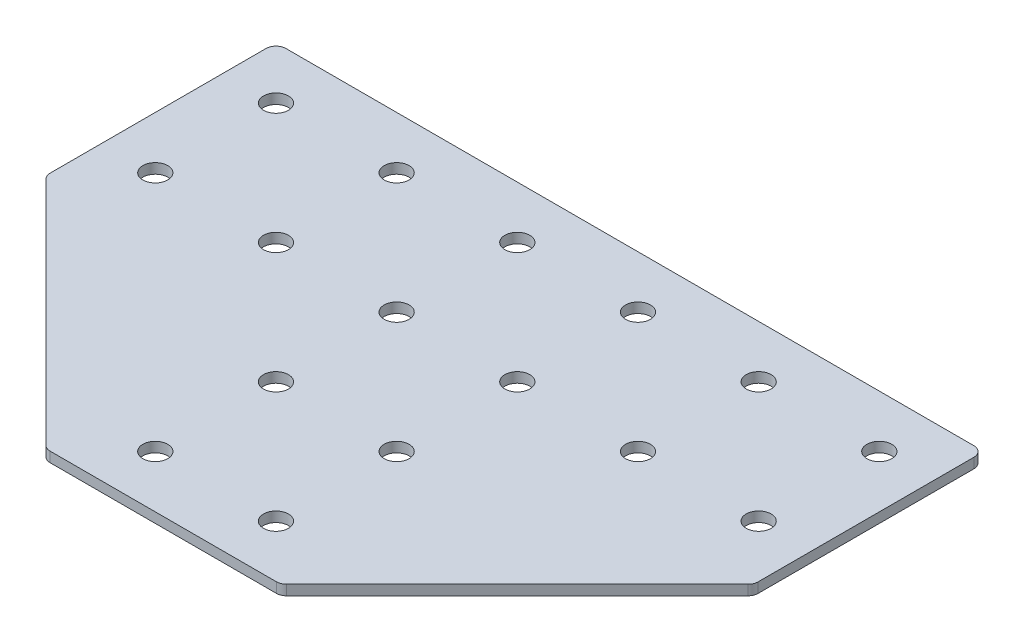
ISO-10303-21;
HEADER;
FILE_DESCRIPTION(('STEP AP214'),'2;1');
FILE_NAME('part.step','',(''),(''),'','','');
FILE_SCHEMA(('AUTOMOTIVE_DESIGN { 1 0 10303 214 1 1 1 1 }'));
ENDSEC;
DATA;
#1=APPLICATION_CONTEXT('core data for automotive mechanical design processes');
#2=APPLICATION_PROTOCOL_DEFINITION('international standard','automotive_design',2000,#1);
#3=PRODUCT_CONTEXT('',#1,'mechanical');
#4=PRODUCT('Part','Part','',(#3));
#5=PRODUCT_RELATED_PRODUCT_CATEGORY('part','',(#4));
#6=PRODUCT_DEFINITION_FORMATION('','',#4);
#7=PRODUCT_DEFINITION_CONTEXT('part definition',#1,'design');
#8=PRODUCT_DEFINITION('design','',#6,#7);
#9=PRODUCT_DEFINITION_SHAPE('','',#8);
#10=(LENGTH_UNIT() NAMED_UNIT(*) SI_UNIT(.MILLI.,.METRE.));
#11=(NAMED_UNIT(*) PLANE_ANGLE_UNIT() SI_UNIT($,.RADIAN.));
#12=(NAMED_UNIT(*) SI_UNIT($,.STERADIAN.) SOLID_ANGLE_UNIT());
#13=UNCERTAINTY_MEASURE_WITH_UNIT(LENGTH_MEASURE(1.E-05),#10,'distance_accuracy_value','');
#14=(GEOMETRIC_REPRESENTATION_CONTEXT(3) GLOBAL_UNCERTAINTY_ASSIGNED_CONTEXT((#13)) GLOBAL_UNIT_ASSIGNED_CONTEXT((#10,
#11,#12)) REPRESENTATION_CONTEXT('',''));
#15=CARTESIAN_POINT('',(0.,0.,0.));
#16=DIRECTION('',(0.,0.,1.));
#17=DIRECTION('',(1.,0.,0.));
#18=AXIS2_PLACEMENT_3D('',#15,#16,#17);
#19=CARTESIAN_POINT('',(-1.82872212002394,1.45798729377475,-30.8788250855786));
#20=DIRECTION('',(0.,-1.,0.));
#21=DIRECTION('',(0.,0.,-1.));
#22=AXIS2_PLACEMENT_3D('',#19,#20,#21);
#23=PLANE('',#22);
#24=DIRECTION('',(1.,0.,0.));
#25=VECTOR('',#24,1.);
#26=CARTESIAN_POINT('',(-29.828722120024,1.45798729377475,57.1211749144213));
#27=LINE('',#26,#25);
#28=CARTESIAN_POINT('',(-29.9647610893451,1.45798729377475,57.1211749144213));
#29=VERTEX_POINT('',#28);
#30=CARTESIAN_POINT('',(26.3073168492972,1.45798729377475,57.1211749144213));
#31=VERTEX_POINT('',#30);
#32=EDGE_CURVE('E218',#29,#31,#27,.T.);
#33=ORIENTED_EDGE('',*,*,#32,.F.);
#34=CARTESIAN_POINT('',(-29.9647610893451,1.45798729377475,54.6211749144213));
#35=DIRECTION('',(0.,1.,0.));
#36=DIRECTION('',(0.,0.,-1.));
#37=AXIS2_PLACEMENT_3D('',#34,#35,#36);
#38=CIRCLE('',#37,2.5);
#39=CARTESIAN_POINT('',(-31.7325280423115,1.45798729377475,56.3889418673877));
#40=VERTEX_POINT('',#39);
#41=EDGE_CURVE('E154',#40,#29,#38,.T.);
#42=ORIENTED_EDGE('',*,*,#41,.F.);
#43=DIRECTION('',(-0.707106781186547,0.,-0.707106781186548));
#44=VECTOR('',#43,1.);
#45=CARTESIAN_POINT('',(-31.0002949952778,1.45798729377475,57.1211749144213));
#46=LINE('',#45,#44);
#47=CARTESIAN_POINT('',(-89.0964890729902,1.45798729377475,-0.975019163291117));
#48=VERTEX_POINT('',#47);
#49=EDGE_CURVE('E141',#40,#48,#46,.T.);
#50=ORIENTED_EDGE('',*,*,#49,.T.);
#51=CARTESIAN_POINT('',(-87.3287221200238,1.45798729377475,-2.74278611625748));
#52=DIRECTION('',(0.,1.,0.));
#53=DIRECTION('',(0.,0.,-1.));
#54=AXIS2_PLACEMENT_3D('',#51,#52,#53);
#55=CIRCLE('',#54,2.5);
#56=CARTESIAN_POINT('',(-89.8287221200238,1.45798729377475,-2.74278611625748));
#57=VERTEX_POINT('',#56);
#58=EDGE_CURVE('E152',#57,#48,#55,.T.);
#59=ORIENTED_EDGE('',*,*,#58,.F.);
#60=DIRECTION('',(0.,0.,-1.));
#61=VECTOR('',#60,1.);
#62=CARTESIAN_POINT('',(-89.8287221200238,1.45798729377475,-1.70725221032476));
#63=LINE('',#62,#61);
#64=CARTESIAN_POINT('',(-89.8287221200238,1.45798729377475,-56.3788250855787));
#65=VERTEX_POINT('',#64);
#66=EDGE_CURVE('E124',#57,#65,#63,.T.);
#67=ORIENTED_EDGE('',*,*,#66,.T.);
#68=CARTESIAN_POINT('',(-87.3287221200238,1.45798729377475,-56.3788250855787));
#69=DIRECTION('',(0.,1.,0.));
#70=DIRECTION('',(0.,0.,-1.));
#71=AXIS2_PLACEMENT_3D('',#68,#69,#70);
#72=CIRCLE('',#71,2.5);
#73=CARTESIAN_POINT('',(-87.3287221200238,1.45798729377475,-58.8788250855787));
#74=VERTEX_POINT('',#73);
#75=EDGE_CURVE('E149',#74,#65,#72,.T.);
#76=ORIENTED_EDGE('',*,*,#75,.F.);
#77=DIRECTION('',(-1.,0.,0.));
#78=VECTOR('',#77,1.);
#79=CARTESIAN_POINT('',(86.1712778799759,1.45798729377475,-58.8788250855787));
#80=LINE('',#79,#78);
#81=CARTESIAN_POINT('',(83.6712778799759,1.45798729377475,-58.8788250855787));
#82=VERTEX_POINT('',#81);
#83=EDGE_CURVE('E215',#82,#74,#80,.T.);
#84=ORIENTED_EDGE('',*,*,#83,.F.);
#85=CARTESIAN_POINT('',(83.6712778799759,1.45798729377475,-56.3788250855787));
#86=DIRECTION('',(0.,-1.,0.));
#87=DIRECTION('',(0.,0.,-1.));
#88=AXIS2_PLACEMENT_3D('',#85,#86,#87);
#89=CIRCLE('',#88,2.5);
#90=CARTESIAN_POINT('',(86.1712778799759,1.45798729377475,-56.3788250855787));
#91=VERTEX_POINT('',#90);
#92=EDGE_CURVE('E239',#82,#91,#89,.T.);
#93=ORIENTED_EDGE('',*,*,#92,.T.);
#94=DIRECTION('',(0.,0.,-1.));
#95=VECTOR('',#94,1.);
#96=CARTESIAN_POINT('',(86.1712778799759,1.45798729377475,-1.70725221032478));
#97=LINE('',#96,#95);
#98=CARTESIAN_POINT('',(86.1712778799759,1.45798729377475,-2.7427861162575));
#99=VERTEX_POINT('',#98);
#100=EDGE_CURVE('E212',#99,#91,#97,.T.);
#101=ORIENTED_EDGE('',*,*,#100,.F.);
#102=CARTESIAN_POINT('',(83.6712778799759,1.45798729377475,-2.7427861162575));
#103=DIRECTION('',(0.,-1.,0.));
#104=DIRECTION('',(0.,0.,-1.));
#105=AXIS2_PLACEMENT_3D('',#102,#103,#104);
#106=CIRCLE('',#105,2.5);
#107=CARTESIAN_POINT('',(85.4390448329423,1.45798729377475,-0.975019163291138));
#108=VERTEX_POINT('',#107);
#109=EDGE_CURVE('E31',#99,#108,#106,.T.);
#110=ORIENTED_EDGE('',*,*,#109,.T.);
#111=DIRECTION('',(0.707106781186547,0.,-0.707106781186548));
#112=VECTOR('',#111,1.);
#113=CARTESIAN_POINT('',(27.34285075523,1.45798729377475,57.1211749144213));
#114=LINE('',#113,#112);
#115=CARTESIAN_POINT('',(28.0750838022636,1.45798729377475,56.3889418673877));
#116=VERTEX_POINT('',#115);
#117=EDGE_CURVE('E220',#116,#108,#114,.T.);
#118=ORIENTED_EDGE('',*,*,#117,.F.);
#119=CARTESIAN_POINT('',(26.3073168492972,1.45798729377475,54.6211749144213));
#120=DIRECTION('',(0.,-1.,0.));
#121=DIRECTION('',(0.,0.,-1.));
#122=AXIS2_PLACEMENT_3D('',#119,#120,#121);
#123=CIRCLE('',#122,2.5);
#124=EDGE_CURVE('E242',#116,#31,#123,.T.);
#125=ORIENTED_EDGE('',*,*,#124,.T.);
#126=EDGE_LOOP('',(#33,#42,#50,#59,#67,#76,#84,#93,#101,#110,#118,#125));
#127=FACE_BOUND('',#126,.T.);
#128=CARTESIAN_POINT('',(73.171277879976,1.45798729377475,-15.8788250855786));
#129=DIRECTION('',(0.,1.,0.));
#130=DIRECTION('',(0.,0.,1.));
#131=AXIS2_PLACEMENT_3D('',#128,#129,#130);
#132=CIRCLE('',#131,3.1);
#133=CARTESIAN_POINT('',(73.171277879976,1.45798729377475,-12.7788250855786));
#134=VERTEX_POINT('',#133);
#135=EDGE_CURVE('E164',#134,#134,#132,.T.);
#136=ORIENTED_EDGE('',*,*,#135,.T.);
#137=EDGE_LOOP('',(#136));
#138=FACE_BOUND('',#137,.T.);
#139=CARTESIAN_POINT('',(43.171277879976,1.45798729377475,-15.8788250855786));
#140=DIRECTION('',(0.,1.,0.));
#141=DIRECTION('',(0.,0.,1.));
#142=AXIS2_PLACEMENT_3D('',#139,#140,#141);
#143=CIRCLE('',#142,3.1);
#144=CARTESIAN_POINT('',(43.171277879976,1.45798729377475,-12.7788250855786));
#145=VERTEX_POINT('',#144);
#146=EDGE_CURVE('E170',#145,#145,#143,.T.);
#147=ORIENTED_EDGE('',*,*,#146,.T.);
#148=EDGE_LOOP('',(#147));
#149=FACE_BOUND('',#148,.T.);
#150=CARTESIAN_POINT('',(13.1712778799761,1.45798729377475,44.1211749144214));
#151=DIRECTION('',(0.,1.,0.));
#152=DIRECTION('',(0.,0.,1.));
#153=AXIS2_PLACEMENT_3D('',#150,#151,#152);
#154=CIRCLE('',#153,3.1);
#155=CARTESIAN_POINT('',(13.1712778799761,1.45798729377475,47.2211749144214));
#156=VERTEX_POINT('',#155);
#157=EDGE_CURVE('E176',#156,#156,#154,.T.);
#158=ORIENTED_EDGE('',*,*,#157,.T.);
#159=EDGE_LOOP('',(#158));
#160=FACE_BOUND('',#159,.T.);
#161=CARTESIAN_POINT('',(13.1712778799761,1.45798729377475,14.1211749144214));
#162=DIRECTION('',(0.,1.,0.));
#163=DIRECTION('',(0.,0.,1.));
#164=AXIS2_PLACEMENT_3D('',#161,#162,#163);
#165=CIRCLE('',#164,3.1);
#166=CARTESIAN_POINT('',(13.1712778799761,1.45798729377475,17.2211749144214));
#167=VERTEX_POINT('',#166);
#168=EDGE_CURVE('E182',#167,#167,#165,.T.);
#169=ORIENTED_EDGE('',*,*,#168,.T.);
#170=EDGE_LOOP('',(#169));
#171=FACE_BOUND('',#170,.T.);
#172=CARTESIAN_POINT('',(13.171277879976,1.45798729377475,-15.8788250855786));
#173=DIRECTION('',(0.,1.,0.));
#174=DIRECTION('',(0.,0.,1.));
#175=AXIS2_PLACEMENT_3D('',#172,#173,#174);
#176=CIRCLE('',#175,3.1);
#177=CARTESIAN_POINT('',(13.171277879976,1.45798729377475,-12.7788250855786));
#178=VERTEX_POINT('',#177);
#179=EDGE_CURVE('E188',#178,#178,#176,.T.);
#180=ORIENTED_EDGE('',*,*,#179,.T.);
#181=EDGE_LOOP('',(#180));
#182=FACE_BOUND('',#181,.T.);
#183=CARTESIAN_POINT('',(73.171277879976,1.45798729377475,-45.8788250855786));
#184=DIRECTION('',(0.,1.,0.));
#185=DIRECTION('',(0.,0.,1.));
#186=AXIS2_PLACEMENT_3D('',#183,#184,#185);
#187=CIRCLE('',#186,3.1);
#188=CARTESIAN_POINT('',(73.171277879976,1.45798729377475,-42.7788250855786));
#189=VERTEX_POINT('',#188);
#190=EDGE_CURVE('E194',#189,#189,#187,.T.);
#191=ORIENTED_EDGE('',*,*,#190,.T.);
#192=EDGE_LOOP('',(#191));
#193=FACE_BOUND('',#192,.T.);
#194=CARTESIAN_POINT('',(43.171277879976,1.45798729377475,-45.8788250855786));
#195=DIRECTION('',(0.,1.,0.));
#196=DIRECTION('',(0.,0.,1.));
#197=AXIS2_PLACEMENT_3D('',#194,#195,#196);
#198=CIRCLE('',#197,3.1);
#199=CARTESIAN_POINT('',(43.171277879976,1.45798729377475,-42.7788250855786));
#200=VERTEX_POINT('',#199);
#201=EDGE_CURVE('E200',#200,#200,#198,.T.);
#202=ORIENTED_EDGE('',*,*,#201,.T.);
#203=EDGE_LOOP('',(#202));
#204=FACE_BOUND('',#203,.T.);
#205=CARTESIAN_POINT('',(13.171277879976,1.45798729377475,-45.8788250855786));
#206=DIRECTION('',(0.,1.,0.));
#207=DIRECTION('',(0.,0.,1.));
#208=AXIS2_PLACEMENT_3D('',#205,#206,#207);
#209=CIRCLE('',#208,3.1);
#210=CARTESIAN_POINT('',(13.171277879976,1.45798729377475,-42.7788250855786));
#211=VERTEX_POINT('',#210);
#212=EDGE_CURVE('E206',#211,#211,#209,.T.);
#213=ORIENTED_EDGE('',*,*,#212,.T.);
#214=EDGE_LOOP('',(#213));
#215=FACE_BOUND('',#214,.T.);
#216=CARTESIAN_POINT('',(-76.8287221200239,1.45798729377475,-15.8788250855786));
#217=DIRECTION('',(0.,-1.,0.));
#218=DIRECTION('',(0.,0.,1.));
#219=AXIS2_PLACEMENT_3D('',#216,#217,#218);
#220=CIRCLE('',#219,3.1);
#221=CARTESIAN_POINT('',(-76.8287221200239,1.45798729377475,-12.7788250855786));
#222=VERTEX_POINT('',#221);
#223=EDGE_CURVE('E318',#222,#222,#220,.T.);
#224=ORIENTED_EDGE('',*,*,#223,.F.);
#225=EDGE_LOOP('',(#224));
#226=FACE_BOUND('',#225,.T.);
#227=CARTESIAN_POINT('',(-46.8287221200239,1.45798729377475,-15.8788250855786));
#228=DIRECTION('',(0.,-1.,0.));
#229=DIRECTION('',(0.,0.,1.));
#230=AXIS2_PLACEMENT_3D('',#227,#228,#229);
#231=CIRCLE('',#230,3.1);
#232=CARTESIAN_POINT('',(-46.8287221200239,1.45798729377475,-12.7788250855786));
#233=VERTEX_POINT('',#232);
#234=EDGE_CURVE('E312',#233,#233,#231,.T.);
#235=ORIENTED_EDGE('',*,*,#234,.F.);
#236=EDGE_LOOP('',(#235));
#237=FACE_BOUND('',#236,.T.);
#238=CARTESIAN_POINT('',(-16.8287221200239,1.45798729377475,44.1211749144214));
#239=DIRECTION('',(0.,-1.,0.));
#240=DIRECTION('',(0.,0.,1.));
#241=AXIS2_PLACEMENT_3D('',#238,#239,#240);
#242=CIRCLE('',#241,3.1);
#243=CARTESIAN_POINT('',(-16.8287221200239,1.45798729377475,47.2211749144214));
#244=VERTEX_POINT('',#243);
#245=EDGE_CURVE('E306',#244,#244,#242,.T.);
#246=ORIENTED_EDGE('',*,*,#245,.F.);
#247=EDGE_LOOP('',(#246));
#248=FACE_BOUND('',#247,.T.);
#249=CARTESIAN_POINT('',(-16.8287221200239,1.45798729377475,14.1211749144214));
#250=DIRECTION('',(0.,-1.,0.));
#251=DIRECTION('',(0.,0.,1.));
#252=AXIS2_PLACEMENT_3D('',#249,#250,#251);
#253=CIRCLE('',#252,3.1);
#254=CARTESIAN_POINT('',(-16.8287221200239,1.45798729377475,17.2211749144214));
#255=VERTEX_POINT('',#254);
#256=EDGE_CURVE('E300',#255,#255,#253,.T.);
#257=ORIENTED_EDGE('',*,*,#256,.F.);
#258=EDGE_LOOP('',(#257));
#259=FACE_BOUND('',#258,.T.);
#260=CARTESIAN_POINT('',(-16.8287221200239,1.45798729377475,-15.8788250855786));
#261=DIRECTION('',(0.,-1.,0.));
#262=DIRECTION('',(0.,0.,1.));
#263=AXIS2_PLACEMENT_3D('',#260,#261,#262);
#264=CIRCLE('',#263,3.1);
#265=CARTESIAN_POINT('',(-16.8287221200239,1.45798729377475,-12.7788250855786));
#266=VERTEX_POINT('',#265);
#267=EDGE_CURVE('E294',#266,#266,#264,.T.);
#268=ORIENTED_EDGE('',*,*,#267,.F.);
#269=EDGE_LOOP('',(#268));
#270=FACE_BOUND('',#269,.T.);
#271=CARTESIAN_POINT('',(-76.8287221200239,1.45798729377475,-45.8788250855786));
#272=DIRECTION('',(0.,-1.,0.));
#273=DIRECTION('',(0.,0.,1.));
#274=AXIS2_PLACEMENT_3D('',#271,#272,#273);
#275=CIRCLE('',#274,3.1);
#276=CARTESIAN_POINT('',(-76.8287221200239,1.45798729377475,-42.7788250855786));
#277=VERTEX_POINT('',#276);
#278=EDGE_CURVE('E288',#277,#277,#275,.T.);
#279=ORIENTED_EDGE('',*,*,#278,.F.);
#280=EDGE_LOOP('',(#279));
#281=FACE_BOUND('',#280,.T.);
#282=CARTESIAN_POINT('',(-46.8287221200239,1.45798729377475,-45.8788250855786));
#283=DIRECTION('',(0.,-1.,0.));
#284=DIRECTION('',(0.,0.,1.));
#285=AXIS2_PLACEMENT_3D('',#282,#283,#284);
#286=CIRCLE('',#285,3.1);
#287=CARTESIAN_POINT('',(-46.8287221200239,1.45798729377475,-42.7788250855786));
#288=VERTEX_POINT('',#287);
#289=EDGE_CURVE('E283',#288,#288,#286,.T.);
#290=ORIENTED_EDGE('',*,*,#289,.F.);
#291=EDGE_LOOP('',(#290));
#292=FACE_BOUND('',#291,.T.);
#293=CARTESIAN_POINT('',(-16.8287221200239,1.45798729377475,-45.8788250855786));
#294=DIRECTION('',(0.,-1.,0.));
#295=DIRECTION('',(0.,0.,1.));
#296=AXIS2_PLACEMENT_3D('',#293,#294,#295);
#297=CIRCLE('',#296,3.1);
#298=CARTESIAN_POINT('',(-16.8287221200239,1.45798729377475,-42.7788250855786));
#299=VERTEX_POINT('',#298);
#300=EDGE_CURVE('E134',#299,#299,#297,.T.);
#301=ORIENTED_EDGE('',*,*,#300,.F.);
#302=EDGE_LOOP('',(#301));
#303=FACE_BOUND('',#302,.T.);
#304=ADVANCED_FACE('F16',(#127,#138,#149,#160,#171,#182,#193,#204,#215,#226,#237,#248,#259,#270,
#281,#292,#303),#23,.T.);
#305=CARTESIAN_POINT('',(86.1712778799759,1.45798729377475,-1.70725221032478));
#306=DIRECTION('',(1.,0.,0.));
#307=DIRECTION('',(0.,0.,-1.));
#308=AXIS2_PLACEMENT_3D('',#305,#306,#307);
#309=PLANE('',#308);
#310=DIRECTION('',(0.,0.,-1.));
#311=VECTOR('',#310,1.);
#312=CARTESIAN_POINT('',(86.1712778799759,3.95798729377475,-1.70725221032478));
#313=LINE('',#312,#311);
#314=CARTESIAN_POINT('',(86.1712778799759,3.95798729377475,-2.7427861162575));
#315=VERTEX_POINT('',#314);
#316=CARTESIAN_POINT('',(86.1712778799759,3.95798729377475,-56.3788250855787));
#317=VERTEX_POINT('',#316);
#318=EDGE_CURVE('E209',#315,#317,#313,.T.);
#319=ORIENTED_EDGE('',*,*,#318,.F.);
#320=DIRECTION('',(0.,1.,0.));
#321=VECTOR('',#320,1.);
#322=CARTESIAN_POINT('',(86.1712778799759,1.45798729377475,-2.7427861162575));
#323=LINE('',#322,#321);
#324=EDGE_CURVE('E24',#315,#99,#323,.F.);
#325=ORIENTED_EDGE('',*,*,#324,.T.);
#326=ORIENTED_EDGE('',*,*,#100,.T.);
#327=DIRECTION('',(0.,1.,0.));
#328=VECTOR('',#327,1.);
#329=CARTESIAN_POINT('',(86.1712778799759,1.45798729377475,-56.3788250855787));
#330=LINE('',#329,#328);
#331=EDGE_CURVE('E249',#91,#317,#330,.T.);
#332=ORIENTED_EDGE('',*,*,#331,.T.);
#333=EDGE_LOOP('',(#319,#325,#326,#332));
#334=FACE_BOUND('',#333,.T.);
#335=ADVANCED_FACE('F254',(#334),#309,.T.);
#336=CARTESIAN_POINT('',(27.34285075523,1.45798729377475,57.1211749144213));
#337=DIRECTION('',(0.707106781186548,0.,0.707106781186547));
#338=DIRECTION('',(0.707106781186547,0.,-0.707106781186548));
#339=AXIS2_PLACEMENT_3D('',#336,#337,#338);
#340=PLANE('',#339);
#341=DIRECTION('',(0.707106781186547,0.,-0.707106781186548));
#342=VECTOR('',#341,1.);
#343=CARTESIAN_POINT('',(27.34285075523,3.95798729377475,57.1211749144213));
#344=LINE('',#343,#342);
#345=CARTESIAN_POINT('',(28.0750838022636,3.95798729377475,56.3889418673877));
#346=VERTEX_POINT('',#345);
#347=CARTESIAN_POINT('',(85.4390448329423,3.95798729377475,-0.975019163291138));
#348=VERTEX_POINT('',#347);
#349=EDGE_CURVE('E216',#346,#348,#344,.T.);
#350=ORIENTED_EDGE('',*,*,#349,.F.);
#351=DIRECTION('',(0.,1.,0.));
#352=VECTOR('',#351,1.);
#353=CARTESIAN_POINT('',(28.0750838022636,1.45798729377475,56.3889418673877));
#354=LINE('',#353,#352);
#355=EDGE_CURVE('E38',#346,#116,#354,.F.);
#356=ORIENTED_EDGE('',*,*,#355,.T.);
#357=ORIENTED_EDGE('',*,*,#117,.T.);
#358=DIRECTION('',(0.,1.,0.));
#359=VECTOR('',#358,1.);
#360=CARTESIAN_POINT('',(85.4390448329423,1.45798729377475,-0.975019163291138));
#361=LINE('',#360,#359);
#362=EDGE_CURVE('E245',#108,#348,#361,.T.);
#363=ORIENTED_EDGE('',*,*,#362,.T.);
#364=EDGE_LOOP('',(#350,#356,#357,#363));
#365=FACE_BOUND('',#364,.T.);
#366=ADVANCED_FACE('F262',(#365),#340,.T.);
#367=CARTESIAN_POINT('',(-29.828722120024,1.45798729377475,57.1211749144213));
#368=DIRECTION('',(0.,0.,1.));
#369=DIRECTION('',(1.,0.,0.));
#370=AXIS2_PLACEMENT_3D('',#367,#368,#369);
#371=PLANE('',#370);
#372=DIRECTION('',(1.,0.,0.));
#373=VECTOR('',#372,1.);
#374=CARTESIAN_POINT('',(-29.828722120024,3.95798729377475,57.1211749144213));
#375=LINE('',#374,#373);
#376=CARTESIAN_POINT('',(-29.9647610893451,3.95798729377475,57.1211749144213));
#377=VERTEX_POINT('',#376);
#378=CARTESIAN_POINT('',(26.3073168492972,3.95798729377475,57.1211749144213));
#379=VERTEX_POINT('',#378);
#380=EDGE_CURVE('E227',#377,#379,#375,.T.);
#381=ORIENTED_EDGE('',*,*,#380,.F.);
#382=DIRECTION('',(0.,1.,0.));
#383=VECTOR('',#382,1.);
#384=CARTESIAN_POINT('',(-29.9647610893451,1.45798729377475,57.1211749144213));
#385=LINE('',#384,#383);
#386=EDGE_CURVE('E146',#29,#377,#385,.T.);
#387=ORIENTED_EDGE('',*,*,#386,.F.);
#388=ORIENTED_EDGE('',*,*,#32,.T.);
#389=DIRECTION('',(0.,1.,0.));
#390=VECTOR('',#389,1.);
#391=CARTESIAN_POINT('',(26.3073168492972,1.45798729377475,57.1211749144213));
#392=LINE('',#391,#390);
#393=EDGE_CURVE('E236',#31,#379,#392,.T.);
#394=ORIENTED_EDGE('',*,*,#393,.T.);
#395=EDGE_LOOP('',(#381,#387,#388,#394));
#396=FACE_BOUND('',#395,.T.);
#397=ADVANCED_FACE('F270',(#396),#371,.T.);
#398=CARTESIAN_POINT('',(86.1712778799759,1.45798729377475,-58.8788250855787));
#399=DIRECTION('',(0.,0.,-1.));
#400=DIRECTION('',(-1.,0.,0.));
#401=AXIS2_PLACEMENT_3D('',#398,#399,#400);
#402=PLANE('',#401);
#403=ORIENTED_EDGE('',*,*,#83,.T.);
#404=DIRECTION('',(0.,1.,0.));
#405=VECTOR('',#404,1.);
#406=CARTESIAN_POINT('',(-87.3287221200238,1.45798729377475,-58.8788250855787));
#407=LINE('',#406,#405);
#408=CARTESIAN_POINT('',(-87.3287221200238,3.95798729377475,-58.8788250855787));
#409=VERTEX_POINT('',#408);
#410=EDGE_CURVE('E126',#409,#74,#407,.F.);
#411=ORIENTED_EDGE('',*,*,#410,.F.);
#412=DIRECTION('',(-1.,0.,0.));
#413=VECTOR('',#412,1.);
#414=CARTESIAN_POINT('',(86.1712778799759,3.95798729377475,-58.8788250855787));
#415=LINE('',#414,#413);
#416=CARTESIAN_POINT('',(83.6712778799759,3.95798729377475,-58.8788250855787));
#417=VERTEX_POINT('',#416);
#418=EDGE_CURVE('E225',#417,#409,#415,.T.);
#419=ORIENTED_EDGE('',*,*,#418,.F.);
#420=DIRECTION('',(0.,1.,0.));
#421=VECTOR('',#420,1.);
#422=CARTESIAN_POINT('',(83.6712778799759,1.45798729377475,-58.8788250855787));
#423=LINE('',#422,#421);
#424=EDGE_CURVE('E10',#417,#82,#423,.F.);
#425=ORIENTED_EDGE('',*,*,#424,.T.);
#426=EDGE_LOOP('',(#403,#411,#419,#425));
#427=FACE_BOUND('',#426,.T.);
#428=ADVANCED_FACE('F356',(#427),#402,.T.);
#429=CARTESIAN_POINT('',(-1.82872212002394,3.95798729377475,-30.8788250855786));
#430=DIRECTION('',(0.,-1.,0.));
#431=DIRECTION('',(0.,0.,-1.));
#432=AXIS2_PLACEMENT_3D('',#429,#430,#431);
#433=PLANE('',#432);
#434=CARTESIAN_POINT('',(73.171277879976,3.95798729377475,-15.8788250855786));
#435=DIRECTION('',(0.,1.,0.));
#436=DIRECTION('',(0.,0.,1.));
#437=AXIS2_PLACEMENT_3D('',#434,#435,#436);
#438=CIRCLE('',#437,3.1);
#439=CARTESIAN_POINT('',(73.171277879976,3.95798729377475,-12.7788250855786));
#440=VERTEX_POINT('',#439);
#441=EDGE_CURVE('E163',#440,#440,#438,.T.);
#442=ORIENTED_EDGE('',*,*,#441,.F.);
#443=EDGE_LOOP('',(#442));
#444=FACE_BOUND('',#443,.T.);
#445=CARTESIAN_POINT('',(43.171277879976,3.95798729377475,-15.8788250855786));
#446=DIRECTION('',(0.,1.,0.));
#447=DIRECTION('',(0.,0.,1.));
#448=AXIS2_PLACEMENT_3D('',#445,#446,#447);
#449=CIRCLE('',#448,3.1);
#450=CARTESIAN_POINT('',(43.171277879976,3.95798729377475,-12.7788250855786));
#451=VERTEX_POINT('',#450);
#452=EDGE_CURVE('E167',#451,#451,#449,.T.);
#453=ORIENTED_EDGE('',*,*,#452,.F.);
#454=EDGE_LOOP('',(#453));
#455=FACE_BOUND('',#454,.T.);
#456=CARTESIAN_POINT('',(13.1712778799761,3.95798729377475,44.1211749144214));
#457=DIRECTION('',(0.,1.,0.));
#458=DIRECTION('',(0.,0.,1.));
#459=AXIS2_PLACEMENT_3D('',#456,#457,#458);
#460=CIRCLE('',#459,3.1);
#461=CARTESIAN_POINT('',(13.1712778799761,3.95798729377475,47.2211749144214));
#462=VERTEX_POINT('',#461);
#463=EDGE_CURVE('E173',#462,#462,#460,.T.);
#464=ORIENTED_EDGE('',*,*,#463,.F.);
#465=EDGE_LOOP('',(#464));
#466=FACE_BOUND('',#465,.T.);
#467=CARTESIAN_POINT('',(13.1712778799761,3.95798729377475,14.1211749144214));
#468=DIRECTION('',(0.,1.,0.));
#469=DIRECTION('',(0.,0.,1.));
#470=AXIS2_PLACEMENT_3D('',#467,#468,#469);
#471=CIRCLE('',#470,3.1);
#472=CARTESIAN_POINT('',(13.1712778799761,3.95798729377475,17.2211749144214));
#473=VERTEX_POINT('',#472);
#474=EDGE_CURVE('E179',#473,#473,#471,.T.);
#475=ORIENTED_EDGE('',*,*,#474,.F.);
#476=EDGE_LOOP('',(#475));
#477=FACE_BOUND('',#476,.T.);
#478=CARTESIAN_POINT('',(13.171277879976,3.95798729377475,-15.8788250855786));
#479=DIRECTION('',(0.,1.,0.));
#480=DIRECTION('',(0.,0.,1.));
#481=AXIS2_PLACEMENT_3D('',#478,#479,#480);
#482=CIRCLE('',#481,3.1);
#483=CARTESIAN_POINT('',(13.171277879976,3.95798729377475,-12.7788250855786));
#484=VERTEX_POINT('',#483);
#485=EDGE_CURVE('E185',#484,#484,#482,.T.);
#486=ORIENTED_EDGE('',*,*,#485,.F.);
#487=EDGE_LOOP('',(#486));
#488=FACE_BOUND('',#487,.T.);
#489=CARTESIAN_POINT('',(73.171277879976,3.95798729377475,-45.8788250855786));
#490=DIRECTION('',(0.,1.,0.));
#491=DIRECTION('',(0.,0.,1.));
#492=AXIS2_PLACEMENT_3D('',#489,#490,#491);
#493=CIRCLE('',#492,3.1);
#494=CARTESIAN_POINT('',(73.171277879976,3.95798729377475,-42.7788250855786));
#495=VERTEX_POINT('',#494);
#496=EDGE_CURVE('E191',#495,#495,#493,.T.);
#497=ORIENTED_EDGE('',*,*,#496,.F.);
#498=EDGE_LOOP('',(#497));
#499=FACE_BOUND('',#498,.T.);
#500=CARTESIAN_POINT('',(43.171277879976,3.95798729377475,-45.8788250855786));
#501=DIRECTION('',(0.,1.,0.));
#502=DIRECTION('',(0.,0.,1.));
#503=AXIS2_PLACEMENT_3D('',#500,#501,#502);
#504=CIRCLE('',#503,3.1);
#505=CARTESIAN_POINT('',(43.171277879976,3.95798729377475,-42.7788250855786));
#506=VERTEX_POINT('',#505);
#507=EDGE_CURVE('E197',#506,#506,#504,.T.);
#508=ORIENTED_EDGE('',*,*,#507,.F.);
#509=EDGE_LOOP('',(#508));
#510=FACE_BOUND('',#509,.T.);
#511=CARTESIAN_POINT('',(13.171277879976,3.95798729377475,-45.8788250855786));
#512=DIRECTION('',(0.,1.,0.));
#513=DIRECTION('',(0.,0.,1.));
#514=AXIS2_PLACEMENT_3D('',#511,#512,#513);
#515=CIRCLE('',#514,3.1);
#516=CARTESIAN_POINT('',(13.171277879976,3.95798729377475,-42.7788250855786));
#517=VERTEX_POINT('',#516);
#518=EDGE_CURVE('E203',#517,#517,#515,.T.);
#519=ORIENTED_EDGE('',*,*,#518,.F.);
#520=EDGE_LOOP('',(#519));
#521=FACE_BOUND('',#520,.T.);
#522=ORIENTED_EDGE('',*,*,#418,.T.);
#523=CARTESIAN_POINT('',(-87.3287221200238,3.95798729377475,-56.3788250855787));
#524=DIRECTION('',(0.,1.,0.));
#525=DIRECTION('',(0.,0.,-1.));
#526=AXIS2_PLACEMENT_3D('',#523,#524,#525);
#527=CIRCLE('',#526,2.5);
#528=CARTESIAN_POINT('',(-89.8287221200238,3.95798729377475,-56.3788250855787));
#529=VERTEX_POINT('',#528);
#530=EDGE_CURVE('E117',#529,#409,#527,.F.);
#531=ORIENTED_EDGE('',*,*,#530,.F.);
#532=DIRECTION('',(0.,0.,-1.));
#533=VECTOR('',#532,1.);
#534=CARTESIAN_POINT('',(-89.8287221200238,3.95798729377475,-1.70725221032476));
#535=LINE('',#534,#533);
#536=CARTESIAN_POINT('',(-89.8287221200238,3.95798729377475,-2.74278611625748));
#537=VERTEX_POINT('',#536);
#538=EDGE_CURVE('E122',#537,#529,#535,.T.);
#539=ORIENTED_EDGE('',*,*,#538,.F.);
#540=CARTESIAN_POINT('',(-87.3287221200238,3.95798729377475,-2.74278611625748));
#541=DIRECTION('',(0.,1.,0.));
#542=DIRECTION('',(0.,0.,-1.));
#543=AXIS2_PLACEMENT_3D('',#540,#541,#542);
#544=CIRCLE('',#543,2.5);
#545=CARTESIAN_POINT('',(-89.0964890729902,3.95798729377475,-0.975019163291117));
#546=VERTEX_POINT('',#545);
#547=EDGE_CURVE('E105',#546,#537,#544,.F.);
#548=ORIENTED_EDGE('',*,*,#547,.F.);
#549=DIRECTION('',(-0.707106781186547,0.,-0.707106781186548));
#550=VECTOR('',#549,1.);
#551=CARTESIAN_POINT('',(-31.0002949952778,3.95798729377475,57.1211749144213));
#552=LINE('',#551,#550);
#553=CARTESIAN_POINT('',(-31.7325280423115,3.95798729377475,56.3889418673877));
#554=VERTEX_POINT('',#553);
#555=EDGE_CURVE('E133',#554,#546,#552,.T.);
#556=ORIENTED_EDGE('',*,*,#555,.F.);
#557=CARTESIAN_POINT('',(-29.9647610893451,3.95798729377475,54.6211749144213));
#558=DIRECTION('',(0.,1.,0.));
#559=DIRECTION('',(0.,0.,-1.));
#560=AXIS2_PLACEMENT_3D('',#557,#558,#559);
#561=CIRCLE('',#560,2.5);
#562=EDGE_CURVE('E116',#377,#554,#561,.F.);
#563=ORIENTED_EDGE('',*,*,#562,.F.);
#564=ORIENTED_EDGE('',*,*,#380,.T.);
#565=CARTESIAN_POINT('',(26.3073168492972,3.95798729377475,54.6211749144213));
#566=DIRECTION('',(0.,-1.,0.));
#567=DIRECTION('',(0.,0.,-1.));
#568=AXIS2_PLACEMENT_3D('',#565,#566,#567);
#569=CIRCLE('',#568,2.5);
#570=EDGE_CURVE('E234',#379,#346,#569,.F.);
#571=ORIENTED_EDGE('',*,*,#570,.T.);
#572=ORIENTED_EDGE('',*,*,#349,.T.);
#573=CARTESIAN_POINT('',(83.6712778799759,3.95798729377475,-2.7427861162575));
#574=DIRECTION('',(0.,-1.,0.));
#575=DIRECTION('',(0.,0.,-1.));
#576=AXIS2_PLACEMENT_3D('',#573,#574,#575);
#577=CIRCLE('',#576,2.5);
#578=EDGE_CURVE('E232',#348,#315,#577,.F.);
#579=ORIENTED_EDGE('',*,*,#578,.T.);
#580=ORIENTED_EDGE('',*,*,#318,.T.);
#581=CARTESIAN_POINT('',(83.6712778799759,3.95798729377475,-56.3788250855787));
#582=DIRECTION('',(0.,-1.,0.));
#583=DIRECTION('',(0.,0.,-1.));
#584=AXIS2_PLACEMENT_3D('',#581,#582,#583);
#585=CIRCLE('',#584,2.5);
#586=EDGE_CURVE('E222',#317,#417,#585,.F.);
#587=ORIENTED_EDGE('',*,*,#586,.T.);
#588=EDGE_LOOP('',(#522,#531,#539,#548,#556,#563,#564,#571,#572,#579,#580,#587));
#589=FACE_BOUND('',#588,.T.);
#590=CARTESIAN_POINT('',(-76.8287221200239,3.95798729377475,-15.8788250855786));
#591=DIRECTION('',(0.,-1.,0.));
#592=DIRECTION('',(0.,0.,1.));
#593=AXIS2_PLACEMENT_3D('',#590,#591,#592);
#594=CIRCLE('',#593,3.1);
#595=CARTESIAN_POINT('',(-76.8287221200239,3.95798729377475,-12.7788250855786));
#596=VERTEX_POINT('',#595);
#597=EDGE_CURVE('E321',#596,#596,#594,.T.);
#598=ORIENTED_EDGE('',*,*,#597,.T.);
#599=EDGE_LOOP('',(#598));
#600=FACE_BOUND('',#599,.T.);
#601=CARTESIAN_POINT('',(-46.8287221200239,3.95798729377475,-15.8788250855786));
#602=DIRECTION('',(0.,-1.,0.));
#603=DIRECTION('',(0.,0.,1.));
#604=AXIS2_PLACEMENT_3D('',#601,#602,#603);
#605=CIRCLE('',#604,3.1);
#606=CARTESIAN_POINT('',(-46.8287221200239,3.95798729377475,-12.7788250855786));
#607=VERTEX_POINT('',#606);
#608=EDGE_CURVE('E315',#607,#607,#605,.T.);
#609=ORIENTED_EDGE('',*,*,#608,.T.);
#610=EDGE_LOOP('',(#609));
#611=FACE_BOUND('',#610,.T.);
#612=CARTESIAN_POINT('',(-16.8287221200239,3.95798729377475,44.1211749144214));
#613=DIRECTION('',(0.,-1.,0.));
#614=DIRECTION('',(0.,0.,1.));
#615=AXIS2_PLACEMENT_3D('',#612,#613,#614);
#616=CIRCLE('',#615,3.1);
#617=CARTESIAN_POINT('',(-16.8287221200239,3.95798729377475,47.2211749144214));
#618=VERTEX_POINT('',#617);
#619=EDGE_CURVE('E309',#618,#618,#616,.T.);
#620=ORIENTED_EDGE('',*,*,#619,.T.);
#621=EDGE_LOOP('',(#620));
#622=FACE_BOUND('',#621,.T.);
#623=CARTESIAN_POINT('',(-16.8287221200239,3.95798729377475,14.1211749144214));
#624=DIRECTION('',(0.,-1.,0.));
#625=DIRECTION('',(0.,0.,1.));
#626=AXIS2_PLACEMENT_3D('',#623,#624,#625);
#627=CIRCLE('',#626,3.1);
#628=CARTESIAN_POINT('',(-16.8287221200239,3.95798729377475,17.2211749144214));
#629=VERTEX_POINT('',#628);
#630=EDGE_CURVE('E303',#629,#629,#627,.T.);
#631=ORIENTED_EDGE('',*,*,#630,.T.);
#632=EDGE_LOOP('',(#631));
#633=FACE_BOUND('',#632,.T.);
#634=CARTESIAN_POINT('',(-16.8287221200239,3.95798729377475,-15.8788250855786));
#635=DIRECTION('',(0.,-1.,0.));
#636=DIRECTION('',(0.,0.,1.));
#637=AXIS2_PLACEMENT_3D('',#634,#635,#636);
#638=CIRCLE('',#637,3.1);
#639=CARTESIAN_POINT('',(-16.8287221200239,3.95798729377475,-12.7788250855786));
#640=VERTEX_POINT('',#639);
#641=EDGE_CURVE('E297',#640,#640,#638,.T.);
#642=ORIENTED_EDGE('',*,*,#641,.T.);
#643=EDGE_LOOP('',(#642));
#644=FACE_BOUND('',#643,.T.);
#645=CARTESIAN_POINT('',(-76.8287221200239,3.95798729377475,-45.8788250855786));
#646=DIRECTION('',(0.,-1.,0.));
#647=DIRECTION('',(0.,0.,1.));
#648=AXIS2_PLACEMENT_3D('',#645,#646,#647);
#649=CIRCLE('',#648,3.1);
#650=CARTESIAN_POINT('',(-76.8287221200239,3.95798729377475,-42.7788250855786));
#651=VERTEX_POINT('',#650);
#652=EDGE_CURVE('E291',#651,#651,#649,.T.);
#653=ORIENTED_EDGE('',*,*,#652,.T.);
#654=EDGE_LOOP('',(#653));
#655=FACE_BOUND('',#654,.T.);
#656=CARTESIAN_POINT('',(-46.8287221200239,3.95798729377475,-45.8788250855786));
#657=DIRECTION('',(0.,-1.,0.));
#658=DIRECTION('',(0.,0.,1.));
#659=AXIS2_PLACEMENT_3D('',#656,#657,#658);
#660=CIRCLE('',#659,3.1);
#661=CARTESIAN_POINT('',(-46.8287221200239,3.95798729377475,-42.7788250855786));
#662=VERTEX_POINT('',#661);
#663=EDGE_CURVE('E285',#662,#662,#660,.T.);
#664=ORIENTED_EDGE('',*,*,#663,.T.);
#665=EDGE_LOOP('',(#664));
#666=FACE_BOUND('',#665,.T.);
#667=CARTESIAN_POINT('',(-16.8287221200239,3.95798729377475,-45.8788250855786));
#668=DIRECTION('',(0.,-1.,0.));
#669=DIRECTION('',(0.,0.,1.));
#670=AXIS2_PLACEMENT_3D('',#667,#668,#669);
#671=CIRCLE('',#670,3.1);
#672=CARTESIAN_POINT('',(-16.8287221200239,3.95798729377475,-42.7788250855786));
#673=VERTEX_POINT('',#672);
#674=EDGE_CURVE('E138',#673,#673,#671,.T.);
#675=ORIENTED_EDGE('',*,*,#674,.T.);
#676=EDGE_LOOP('',(#675));
#677=FACE_BOUND('',#676,.T.);
#678=ADVANCED_FACE('F129',(#444,#455,#466,#477,#488,#499,#510,#521,#589,#600,#611,#622,#633,
#644,#655,#666,#677),#433,.F.);
#679=CARTESIAN_POINT('',(26.3073168492972,1.45798729377475,54.6211749144213));
#680=DIRECTION('',(0.,1.,0.));
#681=DIRECTION('',(0.,0.,1.));
#682=AXIS2_PLACEMENT_3D('',#679,#680,#681);
#683=CYLINDRICAL_SURFACE('',#682,2.5);
#684=ORIENTED_EDGE('',*,*,#124,.F.);
#685=ORIENTED_EDGE('',*,*,#355,.F.);
#686=ORIENTED_EDGE('',*,*,#570,.F.);
#687=ORIENTED_EDGE('',*,*,#393,.F.);
#688=EDGE_LOOP('',(#684,#685,#686,#687));
#689=FACE_BOUND('',#688,.T.);
#690=ADVANCED_FACE('F268',(#689),#683,.T.);
#691=CARTESIAN_POINT('',(83.6712778799759,1.45798729377475,-2.7427861162575));
#692=DIRECTION('',(0.,1.,0.));
#693=DIRECTION('',(0.,0.,1.));
#694=AXIS2_PLACEMENT_3D('',#691,#692,#693);
#695=CYLINDRICAL_SURFACE('',#694,2.5);
#696=ORIENTED_EDGE('',*,*,#109,.F.);
#697=ORIENTED_EDGE('',*,*,#324,.F.);
#698=ORIENTED_EDGE('',*,*,#578,.F.);
#699=ORIENTED_EDGE('',*,*,#362,.F.);
#700=EDGE_LOOP('',(#696,#697,#698,#699));
#701=FACE_BOUND('',#700,.T.);
#702=ADVANCED_FACE('F261',(#701),#695,.T.);
#703=CARTESIAN_POINT('',(83.6712778799759,1.45798729377475,-56.3788250855787));
#704=DIRECTION('',(0.,1.,0.));
#705=DIRECTION('',(0.,0.,1.));
#706=AXIS2_PLACEMENT_3D('',#703,#704,#705);
#707=CYLINDRICAL_SURFACE('',#706,2.5);
#708=ORIENTED_EDGE('',*,*,#92,.F.);
#709=ORIENTED_EDGE('',*,*,#424,.F.);
#710=ORIENTED_EDGE('',*,*,#586,.F.);
#711=ORIENTED_EDGE('',*,*,#331,.F.);
#712=EDGE_LOOP('',(#708,#709,#710,#711));
#713=FACE_BOUND('',#712,.T.);
#714=ADVANCED_FACE('F18',(#713),#707,.T.);
#715=CARTESIAN_POINT('',(13.171277879976,1.45798729377475,-45.8788250855786));
#716=DIRECTION('',(0.,1.,0.));
#717=DIRECTION('',(0.,0.,1.));
#718=AXIS2_PLACEMENT_3D('',#715,#716,#717);
#719=CYLINDRICAL_SURFACE('',#718,3.1);
#720=ORIENTED_EDGE('',*,*,#212,.F.);
#721=EDGE_LOOP('',(#720));
#722=FACE_BOUND('',#721,.T.);
#723=ORIENTED_EDGE('',*,*,#518,.T.);
#724=EDGE_LOOP('',(#723));
#725=FACE_BOUND('',#724,.T.);
#726=ADVANCED_FACE('F374',(#722,#725),#719,.F.);
#727=CARTESIAN_POINT('',(43.171277879976,1.45798729377475,-45.8788250855786));
#728=DIRECTION('',(0.,1.,0.));
#729=DIRECTION('',(0.,0.,1.));
#730=AXIS2_PLACEMENT_3D('',#727,#728,#729);
#731=CYLINDRICAL_SURFACE('',#730,3.1);
#732=ORIENTED_EDGE('',*,*,#201,.F.);
#733=EDGE_LOOP('',(#732));
#734=FACE_BOUND('',#733,.T.);
#735=ORIENTED_EDGE('',*,*,#507,.T.);
#736=EDGE_LOOP('',(#735));
#737=FACE_BOUND('',#736,.T.);
#738=ADVANCED_FACE('F379',(#734,#737),#731,.F.);
#739=CARTESIAN_POINT('',(73.171277879976,1.45798729377475,-45.8788250855786));
#740=DIRECTION('',(0.,1.,0.));
#741=DIRECTION('',(0.,0.,1.));
#742=AXIS2_PLACEMENT_3D('',#739,#740,#741);
#743=CYLINDRICAL_SURFACE('',#742,3.1);
#744=ORIENTED_EDGE('',*,*,#190,.F.);
#745=EDGE_LOOP('',(#744));
#746=FACE_BOUND('',#745,.T.);
#747=ORIENTED_EDGE('',*,*,#496,.T.);
#748=EDGE_LOOP('',(#747));
#749=FACE_BOUND('',#748,.T.);
#750=ADVANCED_FACE('F413',(#746,#749),#743,.F.);
#751=CARTESIAN_POINT('',(13.171277879976,1.45798729377475,-15.8788250855786));
#752=DIRECTION('',(0.,1.,0.));
#753=DIRECTION('',(0.,0.,1.));
#754=AXIS2_PLACEMENT_3D('',#751,#752,#753);
#755=CYLINDRICAL_SURFACE('',#754,3.1);
#756=ORIENTED_EDGE('',*,*,#179,.F.);
#757=EDGE_LOOP('',(#756));
#758=FACE_BOUND('',#757,.T.);
#759=ORIENTED_EDGE('',*,*,#485,.T.);
#760=EDGE_LOOP('',(#759));
#761=FACE_BOUND('',#760,.T.);
#762=ADVANCED_FACE('F409',(#758,#761),#755,.F.);
#763=CARTESIAN_POINT('',(13.1712778799761,1.45798729377475,14.1211749144214));
#764=DIRECTION('',(0.,1.,0.));
#765=DIRECTION('',(0.,0.,1.));
#766=AXIS2_PLACEMENT_3D('',#763,#764,#765);
#767=CYLINDRICAL_SURFACE('',#766,3.1);
#768=ORIENTED_EDGE('',*,*,#168,.F.);
#769=EDGE_LOOP('',(#768));
#770=FACE_BOUND('',#769,.T.);
#771=ORIENTED_EDGE('',*,*,#474,.T.);
#772=EDGE_LOOP('',(#771));
#773=FACE_BOUND('',#772,.T.);
#774=ADVANCED_FACE('F405',(#770,#773),#767,.F.);
#775=CARTESIAN_POINT('',(13.1712778799761,1.45798729377475,44.1211749144214));
#776=DIRECTION('',(0.,1.,0.));
#777=DIRECTION('',(0.,0.,1.));
#778=AXIS2_PLACEMENT_3D('',#775,#776,#777);
#779=CYLINDRICAL_SURFACE('',#778,3.1);
#780=ORIENTED_EDGE('',*,*,#157,.F.);
#781=EDGE_LOOP('',(#780));
#782=FACE_BOUND('',#781,.T.);
#783=ORIENTED_EDGE('',*,*,#463,.T.);
#784=EDGE_LOOP('',(#783));
#785=FACE_BOUND('',#784,.T.);
#786=ADVANCED_FACE('F401',(#782,#785),#779,.F.);
#787=CARTESIAN_POINT('',(43.171277879976,1.45798729377475,-15.8788250855786));
#788=DIRECTION('',(0.,1.,0.));
#789=DIRECTION('',(0.,0.,1.));
#790=AXIS2_PLACEMENT_3D('',#787,#788,#789);
#791=CYLINDRICAL_SURFACE('',#790,3.1);
#792=ORIENTED_EDGE('',*,*,#146,.F.);
#793=EDGE_LOOP('',(#792));
#794=FACE_BOUND('',#793,.T.);
#795=ORIENTED_EDGE('',*,*,#452,.T.);
#796=EDGE_LOOP('',(#795));
#797=FACE_BOUND('',#796,.T.);
#798=ADVANCED_FACE('F397',(#794,#797),#791,.F.);
#799=CARTESIAN_POINT('',(73.171277879976,1.45798729377475,-15.8788250855786));
#800=DIRECTION('',(0.,1.,0.));
#801=DIRECTION('',(0.,0.,1.));
#802=AXIS2_PLACEMENT_3D('',#799,#800,#801);
#803=CYLINDRICAL_SURFACE('',#802,3.1);
#804=ORIENTED_EDGE('',*,*,#135,.F.);
#805=EDGE_LOOP('',(#804));
#806=FACE_BOUND('',#805,.T.);
#807=ORIENTED_EDGE('',*,*,#441,.T.);
#808=EDGE_LOOP('',(#807));
#809=FACE_BOUND('',#808,.T.);
#810=ADVANCED_FACE('F394',(#806,#809),#803,.F.);
#811=CARTESIAN_POINT('',(-89.8287221200238,1.45798729377475,-1.70725221032476));
#812=DIRECTION('',(-1.,0.,0.));
#813=DIRECTION('',(0.,0.,-1.));
#814=AXIS2_PLACEMENT_3D('',#811,#812,#813);
#815=PLANE('',#814);
#816=ORIENTED_EDGE('',*,*,#538,.T.);
#817=DIRECTION('',(0.,1.,0.));
#818=VECTOR('',#817,1.);
#819=CARTESIAN_POINT('',(-89.8287221200238,1.45798729377475,-56.3788250855787));
#820=LINE('',#819,#818);
#821=EDGE_CURVE('E127',#65,#529,#820,.T.);
#822=ORIENTED_EDGE('',*,*,#821,.F.);
#823=ORIENTED_EDGE('',*,*,#66,.F.);
#824=DIRECTION('',(0.,1.,0.));
#825=VECTOR('',#824,1.);
#826=CARTESIAN_POINT('',(-89.8287221200238,1.45798729377475,-2.74278611625748));
#827=LINE('',#826,#825);
#828=EDGE_CURVE('E109',#537,#57,#827,.F.);
#829=ORIENTED_EDGE('',*,*,#828,.F.);
#830=EDGE_LOOP('',(#816,#822,#823,#829));
#831=FACE_BOUND('',#830,.T.);
#832=ADVANCED_FACE('F121',(#831),#815,.T.);
#833=CARTESIAN_POINT('',(-31.0002949952778,1.45798729377475,57.1211749144213));
#834=DIRECTION('',(-0.707106781186548,0.,0.707106781186547));
#835=DIRECTION('',(-0.707106781186547,0.,-0.707106781186548));
#836=AXIS2_PLACEMENT_3D('',#833,#834,#835);
#837=PLANE('',#836);
#838=ORIENTED_EDGE('',*,*,#555,.T.);
#839=DIRECTION('',(0.,1.,0.));
#840=VECTOR('',#839,1.);
#841=CARTESIAN_POINT('',(-89.0964890729902,1.45798729377475,-0.975019163291117));
#842=LINE('',#841,#840);
#843=EDGE_CURVE('E111',#48,#546,#842,.T.);
#844=ORIENTED_EDGE('',*,*,#843,.F.);
#845=ORIENTED_EDGE('',*,*,#49,.F.);
#846=DIRECTION('',(0.,1.,0.));
#847=VECTOR('',#846,1.);
#848=CARTESIAN_POINT('',(-31.7325280423115,1.45798729377475,56.3889418673877));
#849=LINE('',#848,#847);
#850=EDGE_CURVE('E158',#554,#40,#849,.F.);
#851=ORIENTED_EDGE('',*,*,#850,.F.);
#852=EDGE_LOOP('',(#838,#844,#845,#851));
#853=FACE_BOUND('',#852,.T.);
#854=ADVANCED_FACE('F279',(#853),#837,.T.);
#855=CARTESIAN_POINT('',(-29.9647610893451,1.45798729377475,54.6211749144213));
#856=DIRECTION('',(0.,1.,0.));
#857=DIRECTION('',(0.,0.,1.));
#858=AXIS2_PLACEMENT_3D('',#855,#856,#857);
#859=CYLINDRICAL_SURFACE('',#858,2.5);
#860=ORIENTED_EDGE('',*,*,#41,.T.);
#861=ORIENTED_EDGE('',*,*,#386,.T.);
#862=ORIENTED_EDGE('',*,*,#562,.T.);
#863=ORIENTED_EDGE('',*,*,#850,.T.);
#864=EDGE_LOOP('',(#860,#861,#862,#863));
#865=FACE_BOUND('',#864,.T.);
#866=ADVANCED_FACE('F276',(#865),#859,.T.);
#867=CARTESIAN_POINT('',(-87.3287221200238,1.45798729377475,-2.74278611625748));
#868=DIRECTION('',(0.,1.,0.));
#869=DIRECTION('',(0.,0.,1.));
#870=AXIS2_PLACEMENT_3D('',#867,#868,#869);
#871=CYLINDRICAL_SURFACE('',#870,2.5);
#872=ORIENTED_EDGE('',*,*,#58,.T.);
#873=ORIENTED_EDGE('',*,*,#843,.T.);
#874=ORIENTED_EDGE('',*,*,#547,.T.);
#875=ORIENTED_EDGE('',*,*,#828,.T.);
#876=EDGE_LOOP('',(#872,#873,#874,#875));
#877=FACE_BOUND('',#876,.T.);
#878=ADVANCED_FACE('F108',(#877),#871,.T.);
#879=CARTESIAN_POINT('',(-87.3287221200238,1.45798729377475,-56.3788250855787));
#880=DIRECTION('',(0.,1.,0.));
#881=DIRECTION('',(0.,0.,1.));
#882=AXIS2_PLACEMENT_3D('',#879,#880,#881);
#883=CYLINDRICAL_SURFACE('',#882,2.5);
#884=ORIENTED_EDGE('',*,*,#75,.T.);
#885=ORIENTED_EDGE('',*,*,#821,.T.);
#886=ORIENTED_EDGE('',*,*,#530,.T.);
#887=ORIENTED_EDGE('',*,*,#410,.T.);
#888=EDGE_LOOP('',(#884,#885,#886,#887));
#889=FACE_BOUND('',#888,.T.);
#890=ADVANCED_FACE('F351',(#889),#883,.T.);
#891=CARTESIAN_POINT('',(-16.8287221200239,1.45798729377475,-45.8788250855786));
#892=DIRECTION('',(0.,1.,0.));
#893=DIRECTION('',(0.,0.,1.));
#894=AXIS2_PLACEMENT_3D('',#891,#892,#893);
#895=CYLINDRICAL_SURFACE('',#894,3.1);
#896=ORIENTED_EDGE('',*,*,#300,.T.);
#897=EDGE_LOOP('',(#896));
#898=FACE_BOUND('',#897,.T.);
#899=ORIENTED_EDGE('',*,*,#674,.F.);
#900=EDGE_LOOP('',(#899));
#901=FACE_BOUND('',#900,.T.);
#902=ADVANCED_FACE('F347',(#898,#901),#895,.F.);
#903=CARTESIAN_POINT('',(-46.8287221200239,1.45798729377475,-45.8788250855786));
#904=DIRECTION('',(0.,1.,0.));
#905=DIRECTION('',(0.,0.,1.));
#906=AXIS2_PLACEMENT_3D('',#903,#904,#905);
#907=CYLINDRICAL_SURFACE('',#906,3.1);
#908=ORIENTED_EDGE('',*,*,#289,.T.);
#909=EDGE_LOOP('',(#908));
#910=FACE_BOUND('',#909,.T.);
#911=ORIENTED_EDGE('',*,*,#663,.F.);
#912=EDGE_LOOP('',(#911));
#913=FACE_BOUND('',#912,.T.);
#914=ADVANCED_FACE('F350',(#910,#913),#907,.F.);
#915=CARTESIAN_POINT('',(-76.8287221200239,1.45798729377475,-45.8788250855786));
#916=DIRECTION('',(0.,1.,0.));
#917=DIRECTION('',(0.,0.,1.));
#918=AXIS2_PLACEMENT_3D('',#915,#916,#917);
#919=CYLINDRICAL_SURFACE('',#918,3.1);
#920=ORIENTED_EDGE('',*,*,#278,.T.);
#921=EDGE_LOOP('',(#920));
#922=FACE_BOUND('',#921,.T.);
#923=ORIENTED_EDGE('',*,*,#652,.F.);
#924=EDGE_LOOP('',(#923));
#925=FACE_BOUND('',#924,.T.);
#926=ADVANCED_FACE('F552',(#922,#925),#919,.F.);
#927=CARTESIAN_POINT('',(-16.8287221200239,1.45798729377475,-15.8788250855786));
#928=DIRECTION('',(0.,1.,0.));
#929=DIRECTION('',(0.,0.,1.));
#930=AXIS2_PLACEMENT_3D('',#927,#928,#929);
#931=CYLINDRICAL_SURFACE('',#930,3.1);
#932=ORIENTED_EDGE('',*,*,#267,.T.);
#933=EDGE_LOOP('',(#932));
#934=FACE_BOUND('',#933,.T.);
#935=ORIENTED_EDGE('',*,*,#641,.F.);
#936=EDGE_LOOP('',(#935));
#937=FACE_BOUND('',#936,.T.);
#938=ADVANCED_FACE('F562',(#934,#937),#931,.F.);
#939=CARTESIAN_POINT('',(-16.8287221200239,1.45798729377475,14.1211749144214));
#940=DIRECTION('',(0.,1.,0.));
#941=DIRECTION('',(0.,0.,1.));
#942=AXIS2_PLACEMENT_3D('',#939,#940,#941);
#943=CYLINDRICAL_SURFACE('',#942,3.1);
#944=ORIENTED_EDGE('',*,*,#256,.T.);
#945=EDGE_LOOP('',(#944));
#946=FACE_BOUND('',#945,.T.);
#947=ORIENTED_EDGE('',*,*,#630,.F.);
#948=EDGE_LOOP('',(#947));
#949=FACE_BOUND('',#948,.T.);
#950=ADVANCED_FACE('F572',(#946,#949),#943,.F.);
#951=CARTESIAN_POINT('',(-16.8287221200239,1.45798729377475,44.1211749144214));
#952=DIRECTION('',(0.,1.,0.));
#953=DIRECTION('',(0.,0.,1.));
#954=AXIS2_PLACEMENT_3D('',#951,#952,#953);
#955=CYLINDRICAL_SURFACE('',#954,3.1);
#956=ORIENTED_EDGE('',*,*,#245,.T.);
#957=EDGE_LOOP('',(#956));
#958=FACE_BOUND('',#957,.T.);
#959=ORIENTED_EDGE('',*,*,#619,.F.);
#960=EDGE_LOOP('',(#959));
#961=FACE_BOUND('',#960,.T.);
#962=ADVANCED_FACE('F582',(#958,#961),#955,.F.);
#963=CARTESIAN_POINT('',(-46.8287221200239,1.45798729377475,-15.8788250855786));
#964=DIRECTION('',(0.,1.,0.));
#965=DIRECTION('',(0.,0.,1.));
#966=AXIS2_PLACEMENT_3D('',#963,#964,#965);
#967=CYLINDRICAL_SURFACE('',#966,3.1);
#968=ORIENTED_EDGE('',*,*,#234,.T.);
#969=EDGE_LOOP('',(#968));
#970=FACE_BOUND('',#969,.T.);
#971=ORIENTED_EDGE('',*,*,#608,.F.);
#972=EDGE_LOOP('',(#971));
#973=FACE_BOUND('',#972,.T.);
#974=ADVANCED_FACE('F592',(#970,#973),#967,.F.);
#975=CARTESIAN_POINT('',(-76.8287221200239,1.45798729377475,-15.8788250855786));
#976=DIRECTION('',(0.,1.,0.));
#977=DIRECTION('',(0.,0.,1.));
#978=AXIS2_PLACEMENT_3D('',#975,#976,#977);
#979=CYLINDRICAL_SURFACE('',#978,3.1);
#980=ORIENTED_EDGE('',*,*,#223,.T.);
#981=EDGE_LOOP('',(#980));
#982=FACE_BOUND('',#981,.T.);
#983=ORIENTED_EDGE('',*,*,#597,.F.);
#984=EDGE_LOOP('',(#983));
#985=FACE_BOUND('',#984,.T.);
#986=ADVANCED_FACE('F327',(#982,#985),#979,.F.);
#987=CLOSED_SHELL('',(#304,#335,#366,#397,#428,#678,#690,#702,#714,#726,#738,#750,#762,#774,
#786,#798,#810,#832,#854,#866,#878,#890,#902,#914,#926,#938,#950,#962,#974,#986));
#988=MANIFOLD_SOLID_BREP('B1',#987);
#989=ADVANCED_BREP_SHAPE_REPRESENTATION('',(#18,#988),#14);
#990=SHAPE_DEFINITION_REPRESENTATION(#9,#989);
ENDSEC;
END-ISO-10303-21;
